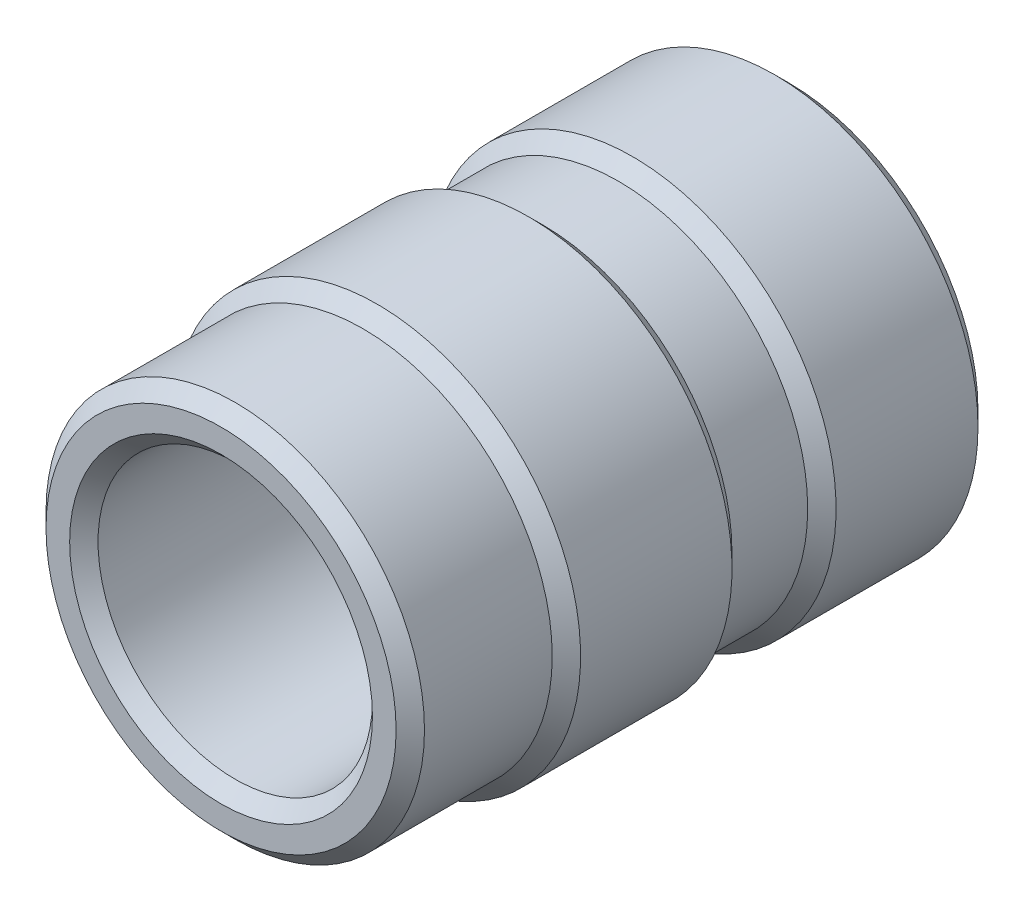
ISO-10303-21;
HEADER;
FILE_DESCRIPTION(('STEP AP214'),'2;1');
FILE_NAME('part.step','',(''),(''),'','','');
FILE_SCHEMA(('AUTOMOTIVE_DESIGN { 1 0 10303 214 1 1 1 1 }'));
ENDSEC;
DATA;
#1=APPLICATION_CONTEXT('core data for automotive mechanical design processes');
#2=APPLICATION_PROTOCOL_DEFINITION('international standard','automotive_design',2000,#1);
#3=PRODUCT_CONTEXT('',#1,'mechanical');
#4=PRODUCT('Part','Part','',(#3));
#5=PRODUCT_RELATED_PRODUCT_CATEGORY('part','',(#4));
#6=PRODUCT_DEFINITION_FORMATION('','',#4);
#7=PRODUCT_DEFINITION_CONTEXT('part definition',#1,'design');
#8=PRODUCT_DEFINITION('design','',#6,#7);
#9=PRODUCT_DEFINITION_SHAPE('','',#8);
#10=(LENGTH_UNIT() NAMED_UNIT(*) SI_UNIT(.MILLI.,.METRE.));
#11=(NAMED_UNIT(*) PLANE_ANGLE_UNIT() SI_UNIT($,.RADIAN.));
#12=(NAMED_UNIT(*) SI_UNIT($,.STERADIAN.) SOLID_ANGLE_UNIT());
#13=UNCERTAINTY_MEASURE_WITH_UNIT(LENGTH_MEASURE(1.E-05),#10,'distance_accuracy_value','');
#14=(GEOMETRIC_REPRESENTATION_CONTEXT(3) GLOBAL_UNCERTAINTY_ASSIGNED_CONTEXT((#13)) GLOBAL_UNIT_ASSIGNED_CONTEXT((#10,
#11,#12)) REPRESENTATION_CONTEXT('',''));
#15=CARTESIAN_POINT('',(0.,0.,0.));
#16=DIRECTION('',(0.,0.,1.));
#17=DIRECTION('',(1.,0.,0.));
#18=AXIS2_PLACEMENT_3D('',#15,#16,#17);
#19=CARTESIAN_POINT('',(0.,0.,6.));
#20=DIRECTION('',(0.,0.,-1.));
#21=DIRECTION('',(-1.,0.,0.));
#22=AXIS2_PLACEMENT_3D('',#19,#20,#21);
#23=CYLINDRICAL_SURFACE('',#22,2.);
#24=CARTESIAN_POINT('',(0.,0.,5.85));
#25=DIRECTION('',(0.,0.,1.));
#26=DIRECTION('',(1.,0.,0.));
#27=AXIS2_PLACEMENT_3D('',#24,#25,#26);
#28=CIRCLE('',#27,2.);
#29=CARTESIAN_POINT('',(2.,0.,5.85));
#30=VERTEX_POINT('',#29);
#31=EDGE_CURVE('E76',#30,#30,#28,.F.);
#32=ORIENTED_EDGE('',*,*,#31,.T.);
#33=EDGE_LOOP('',(#32));
#34=FACE_BOUND('',#33,.T.);
#35=CARTESIAN_POINT('',(0.,0.,4.5));
#36=DIRECTION('',(0.,0.,-1.));
#37=DIRECTION('',(-1.,0.,0.));
#38=AXIS2_PLACEMENT_3D('',#35,#36,#37);
#39=CIRCLE('',#38,2.);
#40=CARTESIAN_POINT('',(-2.,0.,4.5));
#41=VERTEX_POINT('',#40);
#42=EDGE_CURVE('E103',#41,#41,#39,.T.);
#43=ORIENTED_EDGE('',*,*,#42,.F.);
#44=EDGE_LOOP('',(#43));
#45=FACE_BOUND('',#44,.T.);
#46=ADVANCED_FACE('F45',(#34,#45),#23,.T.);
#47=CARTESIAN_POINT('',(0.,0.,2.6));
#48=DIRECTION('',(0.,0.,-1.));
#49=DIRECTION('',(-1.,0.,0.));
#50=AXIS2_PLACEMENT_3D('',#47,#48,#49);
#51=CIRCLE('',#50,2.);
#52=CARTESIAN_POINT('',(-2.,0.,2.6));
#53=VERTEX_POINT('',#52);
#54=EDGE_CURVE('E108',#53,#53,#51,.T.);
#55=ORIENTED_EDGE('',*,*,#54,.T.);
#56=EDGE_LOOP('',(#55));
#57=FACE_BOUND('',#56,.T.);
#58=CARTESIAN_POINT('',(0.,0.,1.8));
#59=DIRECTION('',(0.,0.,-1.));
#60=DIRECTION('',(-1.,0.,0.));
#61=AXIS2_PLACEMENT_3D('',#58,#59,#60);
#62=CIRCLE('',#61,2.);
#63=CARTESIAN_POINT('',(-2.,0.,1.8));
#64=VERTEX_POINT('',#63);
#65=EDGE_CURVE('E107',#64,#64,#62,.T.);
#66=ORIENTED_EDGE('',*,*,#65,.F.);
#67=EDGE_LOOP('',(#66));
#68=FACE_BOUND('',#67,.T.);
#69=ADVANCED_FACE('F119',(#57,#68),#23,.T.);
#70=CARTESIAN_POINT('',(0.,0.,6.));
#71=DIRECTION('',(0.,0.,1.));
#72=DIRECTION('',(1.,0.,0.));
#73=AXIS2_PLACEMENT_3D('',#70,#71,#72);
#74=PLANE('',#73);
#75=CARTESIAN_POINT('',(0.,0.,6.));
#76=DIRECTION('',(0.,0.,1.));
#77=DIRECTION('',(1.,0.,0.));
#78=AXIS2_PLACEMENT_3D('',#75,#76,#77);
#79=CIRCLE('',#78,1.6);
#80=CARTESIAN_POINT('',(1.6,0.,6.));
#81=VERTEX_POINT('',#80);
#82=EDGE_CURVE('E80',#81,#81,#79,.F.);
#83=ORIENTED_EDGE('',*,*,#82,.T.);
#84=EDGE_LOOP('',(#83));
#85=FACE_BOUND('',#84,.T.);
#86=CARTESIAN_POINT('',(0.,0.,6.));
#87=DIRECTION('',(0.,0.,1.));
#88=DIRECTION('',(1.,0.,0.));
#89=AXIS2_PLACEMENT_3D('',#86,#87,#88);
#90=CIRCLE('',#89,1.85);
#91=CARTESIAN_POINT('',(1.85,0.,6.));
#92=VERTEX_POINT('',#91);
#93=EDGE_CURVE('E83',#92,#92,#90,.T.);
#94=ORIENTED_EDGE('',*,*,#93,.T.);
#95=EDGE_LOOP('',(#94));
#96=FACE_BOUND('',#95,.T.);
#97=ADVANCED_FACE('F121',(#85,#96),#74,.T.);
#98=CARTESIAN_POINT('',(0.,0.,0.));
#99=DIRECTION('',(0.,0.,1.));
#100=DIRECTION('',(1.,0.,0.));
#101=AXIS2_PLACEMENT_3D('',#98,#99,#100);
#102=PLANE('',#101);
#103=CARTESIAN_POINT('',(0.,0.,0.));
#104=DIRECTION('',(0.,0.,1.));
#105=DIRECTION('',(1.,0.,0.));
#106=AXIS2_PLACEMENT_3D('',#103,#104,#105);
#107=CIRCLE('',#106,1.6);
#108=CARTESIAN_POINT('',(1.6,0.,0.));
#109=VERTEX_POINT('',#108);
#110=EDGE_CURVE('E95',#109,#109,#107,.T.);
#111=ORIENTED_EDGE('',*,*,#110,.T.);
#112=EDGE_LOOP('',(#111));
#113=FACE_BOUND('',#112,.T.);
#114=CARTESIAN_POINT('',(0.,0.,0.));
#115=DIRECTION('',(0.,0.,1.));
#116=DIRECTION('',(1.,0.,0.));
#117=AXIS2_PLACEMENT_3D('',#114,#115,#116);
#118=CIRCLE('',#117,2.);
#119=CARTESIAN_POINT('',(2.,0.,0.));
#120=VERTEX_POINT('',#119);
#121=EDGE_CURVE('E99',#120,#120,#118,.F.);
#122=ORIENTED_EDGE('',*,*,#121,.T.);
#123=EDGE_LOOP('',(#122));
#124=FACE_BOUND('',#123,.T.);
#125=ADVANCED_FACE('F129',(#113,#124),#102,.F.);
#126=CARTESIAN_POINT('',(0.,0.,6.));
#127=DIRECTION('',(0.,0.,-1.));
#128=DIRECTION('',(-1.,0.,0.));
#129=AXIS2_PLACEMENT_3D('',#126,#127,#128);
#130=CYLINDRICAL_SURFACE('',#129,1.45);
#131=CARTESIAN_POINT('',(0.,0.,0.149999999999999));
#132=DIRECTION('',(0.,0.,1.));
#133=DIRECTION('',(1.,0.,0.));
#134=AXIS2_PLACEMENT_3D('',#131,#132,#133);
#135=CIRCLE('',#134,1.45);
#136=CARTESIAN_POINT('',(1.45,0.,0.149999999999999));
#137=VERTEX_POINT('',#136);
#138=EDGE_CURVE('E87',#137,#137,#135,.F.);
#139=ORIENTED_EDGE('',*,*,#138,.T.);
#140=EDGE_LOOP('',(#139));
#141=FACE_BOUND('',#140,.T.);
#142=CARTESIAN_POINT('',(0.,0.,5.85));
#143=DIRECTION('',(0.,0.,1.));
#144=DIRECTION('',(1.,0.,0.));
#145=AXIS2_PLACEMENT_3D('',#142,#143,#144);
#146=CIRCLE('',#145,1.45);
#147=CARTESIAN_POINT('',(1.45,0.,5.85));
#148=VERTEX_POINT('',#147);
#149=EDGE_CURVE('E91',#148,#148,#146,.T.);
#150=ORIENTED_EDGE('',*,*,#149,.T.);
#151=EDGE_LOOP('',(#150));
#152=FACE_BOUND('',#151,.T.);
#153=ADVANCED_FACE('F187',(#141,#152),#130,.F.);
#154=CARTESIAN_POINT('',(0.,0.,1.8));
#155=DIRECTION('',(0.,0.,-1.));
#156=DIRECTION('',(-1.,0.,0.));
#157=AXIS2_PLACEMENT_3D('',#154,#155,#156);
#158=CYLINDRICAL_SURFACE('',#157,2.15);
#159=CARTESIAN_POINT('',(0.,0.,1.65));
#160=DIRECTION('',(0.,0.,-1.));
#161=DIRECTION('',(-1.,0.,0.));
#162=AXIS2_PLACEMENT_3D('',#159,#160,#161);
#163=CIRCLE('',#162,2.15);
#164=CARTESIAN_POINT('',(-2.15,0.,1.65));
#165=VERTEX_POINT('',#164);
#166=EDGE_CURVE('E10',#165,#165,#163,.T.);
#167=ORIENTED_EDGE('',*,*,#166,.T.);
#168=EDGE_LOOP('',(#167));
#169=FACE_BOUND('',#168,.T.);
#170=CARTESIAN_POINT('',(0.,0.,0.15));
#171=DIRECTION('',(0.,0.,1.));
#172=DIRECTION('',(1.,0.,0.));
#173=AXIS2_PLACEMENT_3D('',#170,#171,#172);
#174=CIRCLE('',#173,2.15);
#175=CARTESIAN_POINT('',(2.15,0.,0.15));
#176=VERTEX_POINT('',#175);
#177=EDGE_CURVE('E70',#176,#176,#174,.T.);
#178=ORIENTED_EDGE('',*,*,#177,.T.);
#179=EDGE_LOOP('',(#178));
#180=FACE_BOUND('',#179,.T.);
#181=ADVANCED_FACE('F182',(#169,#180),#158,.T.);
#182=CARTESIAN_POINT('',(0.,0.,4.5));
#183=DIRECTION('',(0.,0.,-1.));
#184=DIRECTION('',(-1.,0.,0.));
#185=AXIS2_PLACEMENT_3D('',#182,#183,#184);
#186=CYLINDRICAL_SURFACE('',#185,2.15);
#187=CARTESIAN_POINT('',(0.,0.,4.35));
#188=DIRECTION('',(0.,0.,-1.));
#189=DIRECTION('',(-1.,0.,0.));
#190=AXIS2_PLACEMENT_3D('',#187,#188,#189);
#191=CIRCLE('',#190,2.15);
#192=CARTESIAN_POINT('',(-2.15,0.,4.35));
#193=VERTEX_POINT('',#192);
#194=EDGE_CURVE('E54',#193,#193,#191,.T.);
#195=CARTESIAN_POINT('',(0.,0.,2.75));
#196=DIRECTION('',(0.,0.,-1.));
#197=DIRECTION('',(-1.,0.,0.));
#198=AXIS2_PLACEMENT_3D('',#195,#196,#197);
#199=CIRCLE('',#198,2.15);
#200=CARTESIAN_POINT('',(-2.15,0.,2.75));
#201=VERTEX_POINT('',#200);
#202=EDGE_CURVE('E62',#201,#201,#199,.F.);
#203=CARTESIAN_POINT('',(-2.15,0.,4.35));
#204=CARTESIAN_POINT('',(-2.15,0.,4.33333333333333));
#205=CARTESIAN_POINT('',(-2.15,0.,4.31666666666666));
#206=CARTESIAN_POINT('',(-2.15,0.,4.28333333333333));
#207=CARTESIAN_POINT('',(-2.15,0.,4.26666666666666));
#208=CARTESIAN_POINT('',(-2.15,0.,4.23333333333333));
#209=CARTESIAN_POINT('',(-2.15,0.,4.21666666666667));
#210=CARTESIAN_POINT('',(-2.15,0.,4.18333333333333));
#211=CARTESIAN_POINT('',(-2.15,0.,4.16666666666667));
#212=CARTESIAN_POINT('',(-2.15,0.,4.13333333333333));
#213=CARTESIAN_POINT('',(-2.15,0.,4.11666666666667));
#214=CARTESIAN_POINT('',(-2.15,0.,4.08333333333333));
#215=CARTESIAN_POINT('',(-2.15,0.,4.06666666666666));
#216=CARTESIAN_POINT('',(-2.15,0.,4.03333333333333));
#217=CARTESIAN_POINT('',(-2.15,0.,4.01666666666666));
#218=CARTESIAN_POINT('',(-2.15,0.,3.98333333333333));
#219=CARTESIAN_POINT('',(-2.15,0.,3.96666666666666));
#220=CARTESIAN_POINT('',(-2.15,0.,3.93333333333333));
#221=CARTESIAN_POINT('',(-2.15,0.,3.91666666666666));
#222=CARTESIAN_POINT('',(-2.15,0.,3.88333333333333));
#223=CARTESIAN_POINT('',(-2.15,0.,3.86666666666666));
#224=CARTESIAN_POINT('',(-2.15,0.,3.83333333333333));
#225=CARTESIAN_POINT('',(-2.15,0.,3.81666666666666));
#226=CARTESIAN_POINT('',(-2.15,0.,3.78333333333333));
#227=CARTESIAN_POINT('',(-2.15,0.,3.76666666666666));
#228=CARTESIAN_POINT('',(-2.15,0.,3.73333333333333));
#229=CARTESIAN_POINT('',(-2.15,0.,3.71666666666666));
#230=CARTESIAN_POINT('',(-2.15,0.,3.68333333333333));
#231=CARTESIAN_POINT('',(-2.15,0.,3.66666666666666));
#232=CARTESIAN_POINT('',(-2.15,0.,3.63333333333333));
#233=CARTESIAN_POINT('',(-2.15,0.,3.61666666666666));
#234=CARTESIAN_POINT('',(-2.15,0.,3.58333333333333));
#235=CARTESIAN_POINT('',(-2.15,0.,3.56666666666666));
#236=CARTESIAN_POINT('',(-2.15,0.,3.53333333333333));
#237=CARTESIAN_POINT('',(-2.15,0.,3.51666666666666));
#238=CARTESIAN_POINT('',(-2.15,0.,3.48333333333333));
#239=CARTESIAN_POINT('',(-2.15,0.,3.46666666666666));
#240=CARTESIAN_POINT('',(-2.15,0.,3.43333333333333));
#241=CARTESIAN_POINT('',(-2.15,0.,3.41666666666666));
#242=CARTESIAN_POINT('',(-2.15,0.,3.38333333333333));
#243=CARTESIAN_POINT('',(-2.15,0.,3.36666666666666));
#244=CARTESIAN_POINT('',(-2.15,0.,3.33333333333333));
#245=CARTESIAN_POINT('',(-2.15,0.,3.31666666666666));
#246=CARTESIAN_POINT('',(-2.15,0.,3.28333333333333));
#247=CARTESIAN_POINT('',(-2.15,0.,3.26666666666666));
#248=CARTESIAN_POINT('',(-2.15,0.,3.23333333333333));
#249=CARTESIAN_POINT('',(-2.15,0.,3.21666666666666));
#250=CARTESIAN_POINT('',(-2.15,0.,3.18333333333333));
#251=CARTESIAN_POINT('',(-2.15,0.,3.16666666666666));
#252=CARTESIAN_POINT('',(-2.15,0.,3.13333333333333));
#253=CARTESIAN_POINT('',(-2.15,0.,3.11666666666666));
#254=CARTESIAN_POINT('',(-2.15,0.,3.08333333333333));
#255=CARTESIAN_POINT('',(-2.15,0.,3.06666666666666));
#256=CARTESIAN_POINT('',(-2.15,0.,3.03333333333333));
#257=CARTESIAN_POINT('',(-2.15,0.,3.01666666666666));
#258=CARTESIAN_POINT('',(-2.15,0.,2.98333333333333));
#259=CARTESIAN_POINT('',(-2.15,0.,2.96666666666666));
#260=CARTESIAN_POINT('',(-2.15,0.,2.93333333333333));
#261=CARTESIAN_POINT('',(-2.15,0.,2.91666666666666));
#262=CARTESIAN_POINT('',(-2.15,0.,2.88333333333333));
#263=CARTESIAN_POINT('',(-2.15,0.,2.86666666666666));
#264=CARTESIAN_POINT('',(-2.15,0.,2.83333333333333));
#265=CARTESIAN_POINT('',(-2.15,0.,2.81666666666666));
#266=CARTESIAN_POINT('',(-2.15,0.,2.78333333333333));
#267=CARTESIAN_POINT('',(-2.15,0.,2.76666666666666));
#268=CARTESIAN_POINT('',(-2.15,0.,2.75));
#269=B_SPLINE_CURVE_WITH_KNOTS('',3,(#203,#204,#205,#206,#207,#208,#209,#210,#211,#212,#213,
#214,#215,#216,#217,#218,#219,#220,#221,#222,#223,#224,#225,#226,#227,#228,#229,#230,#231,#232,
#233,#234,#235,#236,#237,#238,#239,#240,#241,#242,#243,#244,#245,#246,#247,#248,#249,#250,#251,
#252,#253,#254,#255,#256,#257,#258,#259,#260,#261,#262,#263,#264,#265,#266,#267,#268),
.UNSPECIFIED.,.F.,.F.,(4,2,2,2,2,2,2,2,2,2,2,2,2,2,2,2,2,2,2,2,2,2,2,2,2,2,2,2,2,2,2,2,4),(0.,
0.0500000000000006,0.1,0.150000000000001,0.200000000000001,0.25,0.300000000000001,0.35,
0.400000000000001,0.450000000000001,0.500000000000001,0.550000000000001,0.600000000000001,
0.650000000000001,0.700000000000001,0.750000000000001,0.800000000000001,0.850000000000001,
0.900000000000001,0.950000000000001,1.,1.05,1.1,1.15,1.2,1.25,1.3,1.35,1.4,1.45,1.5,1.55,1.6),.UNSPECIFIED.);
#270=EDGE_CURVE('BSEAM143',#193,#201,#269,.T.);
#271=ORIENTED_EDGE('',*,*,#194,.T.);
#272=ORIENTED_EDGE('',*,*,#202,.T.);
#273=ORIENTED_EDGE('',*,*,#270,.T.);
#274=ORIENTED_EDGE('',*,*,#270,.F.);
#275=EDGE_LOOP('',(#271,#273,#272,#274));
#276=FACE_BOUND('',#275,.T.);
#277=ADVANCED_FACE('F143',(#276),#186,.T.);
#278=CARTESIAN_POINT('',(0.,0.,0.));
#279=DIRECTION('',(0.,0.,-1.));
#280=DIRECTION('',(-1.,0.,0.));
#281=AXIS2_PLACEMENT_3D('',#278,#279,#280);
#282=CONICAL_SURFACE('',#281,1.6,0.785398163397451);
#283=ORIENTED_EDGE('',*,*,#138,.F.);
#284=EDGE_LOOP('',(#283));
#285=FACE_BOUND('',#284,.T.);
#286=ORIENTED_EDGE('',*,*,#110,.F.);
#287=EDGE_LOOP('',(#286));
#288=FACE_BOUND('',#287,.T.);
#289=ADVANCED_FACE('F136',(#285,#288),#282,.F.);
#290=CARTESIAN_POINT('',(0.,0.,5.85));
#291=DIRECTION('',(0.,0.,1.));
#292=DIRECTION('',(1.,0.,0.));
#293=AXIS2_PLACEMENT_3D('',#290,#291,#292);
#294=CONICAL_SURFACE('',#293,1.45,0.785398163397453);
#295=ORIENTED_EDGE('',*,*,#82,.F.);
#296=EDGE_LOOP('',(#295));
#297=FACE_BOUND('',#296,.T.);
#298=ORIENTED_EDGE('',*,*,#149,.F.);
#299=EDGE_LOOP('',(#298));
#300=FACE_BOUND('',#299,.T.);
#301=ADVANCED_FACE('F142',(#297,#300),#294,.F.);
#302=CARTESIAN_POINT('',(0.,0.,6.));
#303=DIRECTION('',(0.,0.,-1.));
#304=DIRECTION('',(-1.,0.,0.));
#305=AXIS2_PLACEMENT_3D('',#302,#303,#304);
#306=CONICAL_SURFACE('',#305,1.85,0.785398163397451);
#307=ORIENTED_EDGE('',*,*,#31,.F.);
#308=EDGE_LOOP('',(#307));
#309=FACE_BOUND('',#308,.T.);
#310=ORIENTED_EDGE('',*,*,#93,.F.);
#311=EDGE_LOOP('',(#310));
#312=FACE_BOUND('',#311,.T.);
#313=ADVANCED_FACE('F150',(#309,#312),#306,.T.);
#314=CARTESIAN_POINT('',(0.,0.,0.));
#315=DIRECTION('',(0.,0.,1.));
#316=DIRECTION('',(1.,0.,0.));
#317=AXIS2_PLACEMENT_3D('',#314,#315,#316);
#318=CONICAL_SURFACE('',#317,2.,0.785398163397448);
#319=ORIENTED_EDGE('',*,*,#177,.F.);
#320=EDGE_LOOP('',(#319));
#321=FACE_BOUND('',#320,.T.);
#322=ORIENTED_EDGE('',*,*,#121,.F.);
#323=EDGE_LOOP('',(#322));
#324=FACE_BOUND('',#323,.T.);
#325=ADVANCED_FACE('F157',(#321,#324),#318,.T.);
#326=CARTESIAN_POINT('',(0.,0.,4.35));
#327=DIRECTION('',(0.,0.,-1.));
#328=DIRECTION('',(-1.,0.,0.));
#329=AXIS2_PLACEMENT_3D('',#326,#327,#328);
#330=CONICAL_SURFACE('',#329,2.15,0.785398163397454);
#331=ORIENTED_EDGE('',*,*,#42,.T.);
#332=EDGE_LOOP('',(#331));
#333=FACE_BOUND('',#332,.T.);
#334=ORIENTED_EDGE('',*,*,#194,.F.);
#335=EDGE_LOOP('',(#334));
#336=FACE_BOUND('',#335,.T.);
#337=ADVANCED_FACE('F164',(#333,#336),#330,.T.);
#338=CARTESIAN_POINT('',(0.,0.,2.6));
#339=DIRECTION('',(0.,0.,1.));
#340=DIRECTION('',(1.,0.,0.));
#341=AXIS2_PLACEMENT_3D('',#338,#339,#340);
#342=CONICAL_SURFACE('',#341,2.,0.785398163397445);
#343=ORIENTED_EDGE('',*,*,#202,.F.);
#344=EDGE_LOOP('',(#343));
#345=FACE_BOUND('',#344,.T.);
#346=ORIENTED_EDGE('',*,*,#54,.F.);
#347=EDGE_LOOP('',(#346));
#348=FACE_BOUND('',#347,.T.);
#349=ADVANCED_FACE('F170',(#345,#348),#342,.T.);
#350=CARTESIAN_POINT('',(0.,0.,1.65));
#351=DIRECTION('',(0.,0.,-1.));
#352=DIRECTION('',(-1.,0.,0.));
#353=AXIS2_PLACEMENT_3D('',#350,#351,#352);
#354=CONICAL_SURFACE('',#353,2.15,0.785398163397451);
#355=ORIENTED_EDGE('',*,*,#65,.T.);
#356=EDGE_LOOP('',(#355));
#357=FACE_BOUND('',#356,.T.);
#358=ORIENTED_EDGE('',*,*,#166,.F.);
#359=EDGE_LOOP('',(#358));
#360=FACE_BOUND('',#359,.T.);
#361=ADVANCED_FACE('F48',(#357,#360),#354,.T.);
#362=CLOSED_SHELL('',(#46,#69,#97,#125,#153,#181,#277,#289,#301,#313,#325,#337,#349,#361));
#363=MANIFOLD_SOLID_BREP('B2',#362);
#364=ADVANCED_BREP_SHAPE_REPRESENTATION('',(#18,#363),#14);
#365=SHAPE_DEFINITION_REPRESENTATION(#9,#364);
ENDSEC;
END-ISO-10303-21;
